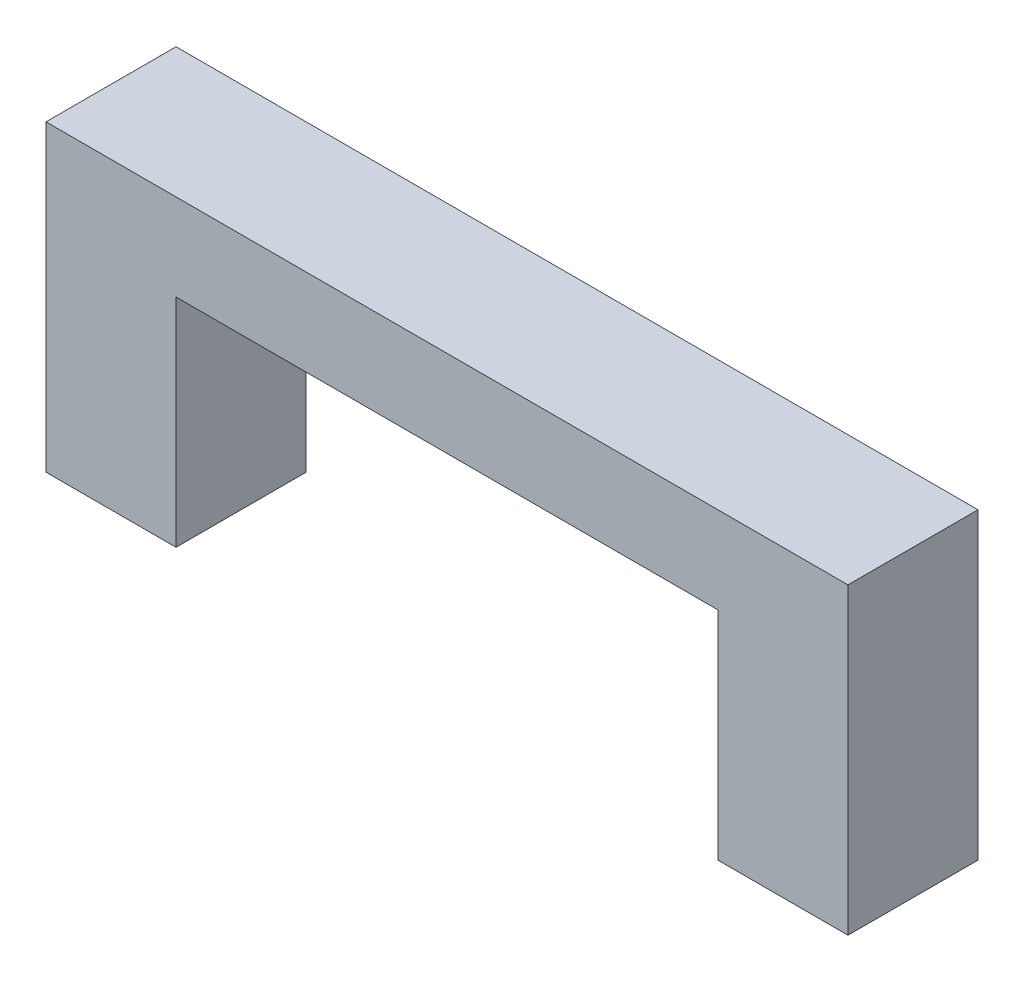
ISO-10303-21;
HEADER;
FILE_DESCRIPTION(('STEP AP214'),'2;1');
FILE_NAME('part.step','',(''),(''),'','','');
FILE_SCHEMA(('AUTOMOTIVE_DESIGN { 1 0 10303 214 1 1 1 1 }'));
ENDSEC;
DATA;
#1=APPLICATION_CONTEXT('core data for automotive mechanical design processes');
#2=APPLICATION_PROTOCOL_DEFINITION('international standard','automotive_design',2000,#1);
#3=PRODUCT_CONTEXT('',#1,'mechanical');
#4=PRODUCT('Part','Part','',(#3));
#5=PRODUCT_RELATED_PRODUCT_CATEGORY('part','',(#4));
#6=PRODUCT_DEFINITION_FORMATION('','',#4);
#7=PRODUCT_DEFINITION_CONTEXT('part definition',#1,'design');
#8=PRODUCT_DEFINITION('design','',#6,#7);
#9=PRODUCT_DEFINITION_SHAPE('','',#8);
#10=(LENGTH_UNIT() NAMED_UNIT(*) SI_UNIT(.MILLI.,.METRE.));
#11=(NAMED_UNIT(*) PLANE_ANGLE_UNIT() SI_UNIT($,.RADIAN.));
#12=(NAMED_UNIT(*) SI_UNIT($,.STERADIAN.) SOLID_ANGLE_UNIT());
#13=UNCERTAINTY_MEASURE_WITH_UNIT(LENGTH_MEASURE(1.E-05),#10,'distance_accuracy_value','');
#14=(GEOMETRIC_REPRESENTATION_CONTEXT(3) GLOBAL_UNCERTAINTY_ASSIGNED_CONTEXT((#13)) GLOBAL_UNIT_ASSIGNED_CONTEXT((#10,
#11,#12)) REPRESENTATION_CONTEXT('',''));
#15=CARTESIAN_POINT('',(0.,0.,0.));
#16=DIRECTION('',(0.,0.,1.));
#17=DIRECTION('',(1.,0.,0.));
#18=AXIS2_PLACEMENT_3D('',#15,#16,#17);
#19=CARTESIAN_POINT('',(18.5,0.,3.));
#20=DIRECTION('',(0.,1.,0.));
#21=DIRECTION('',(-1.,0.,0.));
#22=AXIS2_PLACEMENT_3D('',#19,#20,#21);
#23=PLANE('',#22);
#24=DIRECTION('',(1.,0.,0.));
#25=VECTOR('',#24,1.);
#26=CARTESIAN_POINT('',(18.5,0.,0.));
#27=LINE('',#26,#25);
#28=CARTESIAN_POINT('',(15.5,0.,0.));
#29=VERTEX_POINT('',#28);
#30=CARTESIAN_POINT('',(18.5,0.,0.));
#31=VERTEX_POINT('',#30);
#32=EDGE_CURVE('E236',#29,#31,#27,.T.);
#33=ORIENTED_EDGE('',*,*,#32,.T.);
#34=DIRECTION('',(0.,0.,-1.));
#35=VECTOR('',#34,1.);
#36=CARTESIAN_POINT('',(18.5,0.,3.));
#37=LINE('',#36,#35);
#38=CARTESIAN_POINT('',(18.5,0.,3.));
#39=VERTEX_POINT('',#38);
#40=EDGE_CURVE('E251',#39,#31,#37,.T.);
#41=ORIENTED_EDGE('',*,*,#40,.F.);
#42=DIRECTION('',(1.,0.,0.));
#43=VECTOR('',#42,1.);
#44=CARTESIAN_POINT('',(18.5,0.,3.));
#45=LINE('',#44,#43);
#46=CARTESIAN_POINT('',(15.5,0.,3.));
#47=VERTEX_POINT('',#46);
#48=EDGE_CURVE('E219',#47,#39,#45,.T.);
#49=ORIENTED_EDGE('',*,*,#48,.F.);
#50=DIRECTION('',(0.,0.,-1.));
#51=VECTOR('',#50,1.);
#52=CARTESIAN_POINT('',(15.5,0.,3.));
#53=LINE('',#52,#51);
#54=EDGE_CURVE('E254',#47,#29,#53,.T.);
#55=ORIENTED_EDGE('',*,*,#54,.T.);
#56=EDGE_LOOP('',(#33,#41,#49,#55));
#57=FACE_BOUND('',#56,.T.);
#58=DIRECTION('',(0.,0.,-1.));
#59=VECTOR('',#58,1.);
#60=CARTESIAN_POINT('',(17.75,0.,0.));
#61=LINE('',#60,#59);
#62=CARTESIAN_POINT('',(17.75,0.,2.25));
#63=VERTEX_POINT('',#62);
#64=CARTESIAN_POINT('',(17.75,0.,0.75));
#65=VERTEX_POINT('',#64);
#66=EDGE_CURVE('E56',#63,#65,#61,.T.);
#67=ORIENTED_EDGE('',*,*,#66,.T.);
#68=DIRECTION('',(1.,0.,0.));
#69=VECTOR('',#68,1.);
#70=CARTESIAN_POINT('',(0.,0.,0.75));
#71=LINE('',#70,#69);
#72=CARTESIAN_POINT('',(16.25,0.,0.75));
#73=VERTEX_POINT('',#72);
#74=EDGE_CURVE('E185',#73,#65,#71,.T.);
#75=ORIENTED_EDGE('',*,*,#74,.F.);
#76=DIRECTION('',(0.,0.,-1.));
#77=VECTOR('',#76,1.);
#78=CARTESIAN_POINT('',(16.25,0.,0.));
#79=LINE('',#78,#77);
#80=CARTESIAN_POINT('',(16.25,0.,2.25));
#81=VERTEX_POINT('',#80);
#82=EDGE_CURVE('E196',#81,#73,#79,.T.);
#83=ORIENTED_EDGE('',*,*,#82,.F.);
#84=DIRECTION('',(1.,0.,0.));
#85=VECTOR('',#84,1.);
#86=CARTESIAN_POINT('',(0.,0.,2.25));
#87=LINE('',#86,#85);
#88=EDGE_CURVE('E168',#81,#63,#87,.T.);
#89=ORIENTED_EDGE('',*,*,#88,.T.);
#90=EDGE_LOOP('',(#67,#75,#83,#89));
#91=FACE_BOUND('',#90,.T.);
#92=ADVANCED_FACE('F33',(#57,#91),#23,.F.);
#93=CARTESIAN_POINT('',(3.,0.,3.));
#94=DIRECTION('',(0.,1.,0.));
#95=DIRECTION('',(0.,0.,1.));
#96=AXIS2_PLACEMENT_3D('',#93,#94,#95);
#97=PLANE('',#96);
#98=DIRECTION('',(1.,0.,0.));
#99=VECTOR('',#98,1.);
#100=CARTESIAN_POINT('',(0.75,0.,0.75));
#101=LINE('',#100,#99);
#102=CARTESIAN_POINT('',(0.750000000000001,0.,0.75));
#103=VERTEX_POINT('',#102);
#104=CARTESIAN_POINT('',(2.25,0.,0.75));
#105=VERTEX_POINT('',#104);
#106=EDGE_CURVE('E166',#103,#105,#101,.T.);
#107=ORIENTED_EDGE('',*,*,#106,.F.);
#108=DIRECTION('',(0.,0.,-1.));
#109=VECTOR('',#108,1.);
#110=CARTESIAN_POINT('',(0.75,0.,2.25));
#111=LINE('',#110,#109);
#112=CARTESIAN_POINT('',(0.75,0.,2.25));
#113=VERTEX_POINT('',#112);
#114=EDGE_CURVE('E48',#113,#103,#111,.T.);
#115=ORIENTED_EDGE('',*,*,#114,.F.);
#116=DIRECTION('',(1.,0.,0.));
#117=VECTOR('',#116,1.);
#118=CARTESIAN_POINT('',(0.75,0.,2.25));
#119=LINE('',#118,#117);
#120=CARTESIAN_POINT('',(2.25,0.,2.25));
#121=VERTEX_POINT('',#120);
#122=EDGE_CURVE('E155',#113,#121,#119,.T.);
#123=ORIENTED_EDGE('',*,*,#122,.T.);
#124=DIRECTION('',(0.,0.,-1.));
#125=VECTOR('',#124,1.);
#126=CARTESIAN_POINT('',(2.25,0.,2.25));
#127=LINE('',#126,#125);
#128=EDGE_CURVE('E161',#121,#105,#127,.T.);
#129=ORIENTED_EDGE('',*,*,#128,.T.);
#130=EDGE_LOOP('',(#107,#115,#123,#129));
#131=FACE_BOUND('',#130,.T.);
#132=DIRECTION('',(1.,0.,0.));
#133=VECTOR('',#132,1.);
#134=CARTESIAN_POINT('',(3.,0.,0.));
#135=LINE('',#134,#133);
#136=CARTESIAN_POINT('',(0.,0.,0.));
#137=VERTEX_POINT('',#136);
#138=CARTESIAN_POINT('',(3.,0.,0.));
#139=VERTEX_POINT('',#138);
#140=EDGE_CURVE('E203',#137,#139,#135,.T.);
#141=ORIENTED_EDGE('',*,*,#140,.T.);
#142=DIRECTION('',(0.,0.,-1.));
#143=VECTOR('',#142,1.);
#144=CARTESIAN_POINT('',(3.,0.,3.));
#145=LINE('',#144,#143);
#146=CARTESIAN_POINT('',(3.,0.,3.));
#147=VERTEX_POINT('',#146);
#148=EDGE_CURVE('E11',#147,#139,#145,.T.);
#149=ORIENTED_EDGE('',*,*,#148,.F.);
#150=DIRECTION('',(1.,0.,0.));
#151=VECTOR('',#150,1.);
#152=CARTESIAN_POINT('',(3.,0.,3.));
#153=LINE('',#152,#151);
#154=CARTESIAN_POINT('',(0.,0.,3.));
#155=VERTEX_POINT('',#154);
#156=EDGE_CURVE('E209',#155,#147,#153,.T.);
#157=ORIENTED_EDGE('',*,*,#156,.F.);
#158=DIRECTION('',(0.,0.,-1.));
#159=VECTOR('',#158,1.);
#160=CARTESIAN_POINT('',(0.,0.,3.));
#161=LINE('',#160,#159);
#162=EDGE_CURVE('E227',#155,#137,#161,.T.);
#163=ORIENTED_EDGE('',*,*,#162,.T.);
#164=EDGE_LOOP('',(#141,#149,#157,#163));
#165=FACE_BOUND('',#164,.T.);
#166=ADVANCED_FACE('F35',(#131,#165),#97,.F.);
#167=CARTESIAN_POINT('',(3.,5.,3.));
#168=DIRECTION('',(-1.,0.,0.));
#169=DIRECTION('',(0.,0.,1.));
#170=AXIS2_PLACEMENT_3D('',#167,#168,#169);
#171=PLANE('',#170);
#172=DIRECTION('',(0.,1.,0.));
#173=VECTOR('',#172,1.);
#174=CARTESIAN_POINT('',(3.,5.,0.));
#175=LINE('',#174,#173);
#176=CARTESIAN_POINT('',(3.,5.,0.));
#177=VERTEX_POINT('',#176);
#178=EDGE_CURVE('E230',#139,#177,#175,.T.);
#179=ORIENTED_EDGE('',*,*,#178,.T.);
#180=DIRECTION('',(0.,0.,-1.));
#181=VECTOR('',#180,1.);
#182=CARTESIAN_POINT('',(3.,5.,3.));
#183=LINE('',#182,#181);
#184=CARTESIAN_POINT('',(3.,5.,3.));
#185=VERTEX_POINT('',#184);
#186=EDGE_CURVE('E41',#185,#177,#183,.T.);
#187=ORIENTED_EDGE('',*,*,#186,.F.);
#188=DIRECTION('',(0.,1.,0.));
#189=VECTOR('',#188,1.);
#190=CARTESIAN_POINT('',(3.,5.,3.));
#191=LINE('',#190,#189);
#192=EDGE_CURVE('E212',#147,#185,#191,.T.);
#193=ORIENTED_EDGE('',*,*,#192,.F.);
#194=ORIENTED_EDGE('',*,*,#148,.T.);
#195=EDGE_LOOP('',(#179,#187,#193,#194));
#196=FACE_BOUND('',#195,.T.);
#197=ADVANCED_FACE('F287',(#196),#171,.F.);
#198=CARTESIAN_POINT('',(15.5,5.,3.));
#199=DIRECTION('',(0.,1.,0.));
#200=DIRECTION('',(-1.,0.,0.));
#201=AXIS2_PLACEMENT_3D('',#198,#199,#200);
#202=PLANE('',#201);
#203=DIRECTION('',(1.,0.,0.));
#204=VECTOR('',#203,1.);
#205=CARTESIAN_POINT('',(15.5,5.,0.));
#206=LINE('',#205,#204);
#207=CARTESIAN_POINT('',(15.5,5.,0.));
#208=VERTEX_POINT('',#207);
#209=EDGE_CURVE('E232',#177,#208,#206,.T.);
#210=ORIENTED_EDGE('',*,*,#209,.T.);
#211=DIRECTION('',(0.,0.,-1.));
#212=VECTOR('',#211,1.);
#213=CARTESIAN_POINT('',(15.5,5.,3.));
#214=LINE('',#213,#212);
#215=CARTESIAN_POINT('',(15.5,5.,3.));
#216=VERTEX_POINT('',#215);
#217=EDGE_CURVE('E257',#216,#208,#214,.T.);
#218=ORIENTED_EDGE('',*,*,#217,.F.);
#219=DIRECTION('',(1.,0.,0.));
#220=VECTOR('',#219,1.);
#221=CARTESIAN_POINT('',(15.5,5.,3.));
#222=LINE('',#221,#220);
#223=EDGE_CURVE('E215',#185,#216,#222,.T.);
#224=ORIENTED_EDGE('',*,*,#223,.F.);
#225=ORIENTED_EDGE('',*,*,#186,.T.);
#226=EDGE_LOOP('',(#210,#218,#224,#225));
#227=FACE_BOUND('',#226,.T.);
#228=ADVANCED_FACE('F264',(#227),#202,.F.);
#229=CARTESIAN_POINT('',(15.5,0.,3.));
#230=DIRECTION('',(1.,0.,0.));
#231=DIRECTION('',(0.,0.,-1.));
#232=AXIS2_PLACEMENT_3D('',#229,#230,#231);
#233=PLANE('',#232);
#234=DIRECTION('',(0.,-1.,0.));
#235=VECTOR('',#234,1.);
#236=CARTESIAN_POINT('',(15.5,0.,0.));
#237=LINE('',#236,#235);
#238=EDGE_CURVE('E234',#208,#29,#237,.T.);
#239=ORIENTED_EDGE('',*,*,#238,.T.);
#240=ORIENTED_EDGE('',*,*,#54,.F.);
#241=DIRECTION('',(0.,-1.,0.));
#242=VECTOR('',#241,1.);
#243=CARTESIAN_POINT('',(15.5,0.,3.));
#244=LINE('',#243,#242);
#245=EDGE_CURVE('E217',#216,#47,#244,.T.);
#246=ORIENTED_EDGE('',*,*,#245,.F.);
#247=ORIENTED_EDGE('',*,*,#217,.T.);
#248=EDGE_LOOP('',(#239,#240,#246,#247));
#249=FACE_BOUND('',#248,.T.);
#250=ADVANCED_FACE('F275',(#249),#233,.F.);
#251=CARTESIAN_POINT('',(18.5,7.,3.));
#252=DIRECTION('',(-1.,0.,0.));
#253=DIRECTION('',(0.,0.,1.));
#254=AXIS2_PLACEMENT_3D('',#251,#252,#253);
#255=PLANE('',#254);
#256=DIRECTION('',(0.,1.,0.));
#257=VECTOR('',#256,1.);
#258=CARTESIAN_POINT('',(18.5,7.,0.));
#259=LINE('',#258,#257);
#260=CARTESIAN_POINT('',(18.5,7.,0.));
#261=VERTEX_POINT('',#260);
#262=EDGE_CURVE('E238',#31,#261,#259,.T.);
#263=ORIENTED_EDGE('',*,*,#262,.T.);
#264=DIRECTION('',(0.,0.,-1.));
#265=VECTOR('',#264,1.);
#266=CARTESIAN_POINT('',(18.5,7.,3.));
#267=LINE('',#266,#265);
#268=CARTESIAN_POINT('',(18.5,7.,3.));
#269=VERTEX_POINT('',#268);
#270=EDGE_CURVE('E248',#269,#261,#267,.T.);
#271=ORIENTED_EDGE('',*,*,#270,.F.);
#272=DIRECTION('',(0.,1.,0.));
#273=VECTOR('',#272,1.);
#274=CARTESIAN_POINT('',(18.5,7.,3.));
#275=LINE('',#274,#273);
#276=EDGE_CURVE('E221',#39,#269,#275,.T.);
#277=ORIENTED_EDGE('',*,*,#276,.F.);
#278=ORIENTED_EDGE('',*,*,#40,.T.);
#279=EDGE_LOOP('',(#263,#271,#277,#278));
#280=FACE_BOUND('',#279,.T.);
#281=ADVANCED_FACE('F299',(#280),#255,.F.);
#282=CARTESIAN_POINT('',(0.,7.,3.));
#283=DIRECTION('',(0.,-1.,0.));
#284=DIRECTION('',(0.,0.,-1.));
#285=AXIS2_PLACEMENT_3D('',#282,#283,#284);
#286=PLANE('',#285);
#287=DIRECTION('',(-1.,0.,0.));
#288=VECTOR('',#287,1.);
#289=CARTESIAN_POINT('',(0.,7.,0.));
#290=LINE('',#289,#288);
#291=CARTESIAN_POINT('',(0.,7.,0.));
#292=VERTEX_POINT('',#291);
#293=EDGE_CURVE('E240',#261,#292,#290,.T.);
#294=ORIENTED_EDGE('',*,*,#293,.T.);
#295=DIRECTION('',(0.,0.,-1.));
#296=VECTOR('',#295,1.);
#297=CARTESIAN_POINT('',(0.,7.,3.));
#298=LINE('',#297,#296);
#299=CARTESIAN_POINT('',(0.,7.,3.));
#300=VERTEX_POINT('',#299);
#301=EDGE_CURVE('E245',#300,#292,#298,.T.);
#302=ORIENTED_EDGE('',*,*,#301,.F.);
#303=DIRECTION('',(-1.,0.,0.));
#304=VECTOR('',#303,1.);
#305=CARTESIAN_POINT('',(0.,7.,3.));
#306=LINE('',#305,#304);
#307=EDGE_CURVE('E223',#269,#300,#306,.T.);
#308=ORIENTED_EDGE('',*,*,#307,.F.);
#309=ORIENTED_EDGE('',*,*,#270,.T.);
#310=EDGE_LOOP('',(#294,#302,#308,#309));
#311=FACE_BOUND('',#310,.T.);
#312=ADVANCED_FACE('F297',(#311),#286,.F.);
#313=CARTESIAN_POINT('',(0.,0.,3.));
#314=DIRECTION('',(1.,0.,0.));
#315=DIRECTION('',(0.,0.,-1.));
#316=AXIS2_PLACEMENT_3D('',#313,#314,#315);
#317=PLANE('',#316);
#318=DIRECTION('',(0.,-1.,0.));
#319=VECTOR('',#318,1.);
#320=CARTESIAN_POINT('',(0.,0.,0.));
#321=LINE('',#320,#319);
#322=EDGE_CURVE('E213',#292,#137,#321,.T.);
#323=ORIENTED_EDGE('',*,*,#322,.T.);
#324=ORIENTED_EDGE('',*,*,#162,.F.);
#325=DIRECTION('',(0.,-1.,0.));
#326=VECTOR('',#325,1.);
#327=CARTESIAN_POINT('',(0.,0.,3.));
#328=LINE('',#327,#326);
#329=EDGE_CURVE('E225',#300,#155,#328,.T.);
#330=ORIENTED_EDGE('',*,*,#329,.F.);
#331=ORIENTED_EDGE('',*,*,#301,.T.);
#332=EDGE_LOOP('',(#323,#324,#330,#331));
#333=FACE_BOUND('',#332,.T.);
#334=ADVANCED_FACE('F292',(#333),#317,.F.);
#335=CARTESIAN_POINT('',(0.,0.,3.));
#336=DIRECTION('',(0.,0.,-1.));
#337=DIRECTION('',(-1.,0.,0.));
#338=AXIS2_PLACEMENT_3D('',#335,#336,#337);
#339=PLANE('',#338);
#340=ORIENTED_EDGE('',*,*,#156,.T.);
#341=ORIENTED_EDGE('',*,*,#192,.T.);
#342=ORIENTED_EDGE('',*,*,#223,.T.);
#343=ORIENTED_EDGE('',*,*,#245,.T.);
#344=ORIENTED_EDGE('',*,*,#48,.T.);
#345=ORIENTED_EDGE('',*,*,#276,.T.);
#346=ORIENTED_EDGE('',*,*,#307,.T.);
#347=ORIENTED_EDGE('',*,*,#329,.T.);
#348=EDGE_LOOP('',(#340,#341,#342,#343,#344,#345,#346,#347));
#349=FACE_BOUND('',#348,.T.);
#350=ADVANCED_FACE('F283',(#349),#339,.F.);
#351=CARTESIAN_POINT('',(0.,0.,0.));
#352=DIRECTION('',(0.,0.,-1.));
#353=DIRECTION('',(-1.,0.,0.));
#354=AXIS2_PLACEMENT_3D('',#351,#352,#353);
#355=PLANE('',#354);
#356=ORIENTED_EDGE('',*,*,#140,.F.);
#357=ORIENTED_EDGE('',*,*,#322,.F.);
#358=ORIENTED_EDGE('',*,*,#293,.F.);
#359=ORIENTED_EDGE('',*,*,#262,.F.);
#360=ORIENTED_EDGE('',*,*,#32,.F.);
#361=ORIENTED_EDGE('',*,*,#238,.F.);
#362=ORIENTED_EDGE('',*,*,#209,.F.);
#363=ORIENTED_EDGE('',*,*,#178,.F.);
#364=EDGE_LOOP('',(#356,#357,#358,#359,#360,#361,#362,#363));
#365=FACE_BOUND('',#364,.T.);
#366=ADVANCED_FACE('F270',(#365),#355,.T.);
#367=CARTESIAN_POINT('',(17.75,2.,0.));
#368=DIRECTION('',(-1.,0.,0.));
#369=DIRECTION('',(0.,0.,1.));
#370=AXIS2_PLACEMENT_3D('',#367,#368,#369);
#371=PLANE('',#370);
#372=ORIENTED_EDGE('',*,*,#66,.F.);
#373=DIRECTION('',(0.,-1.,0.));
#374=VECTOR('',#373,1.);
#375=CARTESIAN_POINT('',(17.75,2.,2.25));
#376=LINE('',#375,#374);
#377=CARTESIAN_POINT('',(17.75,2.,2.25));
#378=VERTEX_POINT('',#377);
#379=EDGE_CURVE('E192',#378,#63,#376,.T.);
#380=ORIENTED_EDGE('',*,*,#379,.F.);
#381=DIRECTION('',(0.,0.,-1.));
#382=VECTOR('',#381,1.);
#383=CARTESIAN_POINT('',(17.75,2.,0.));
#384=LINE('',#383,#382);
#385=CARTESIAN_POINT('',(17.75,2.,0.75));
#386=VERTEX_POINT('',#385);
#387=EDGE_CURVE('E182',#378,#386,#384,.T.);
#388=ORIENTED_EDGE('',*,*,#387,.T.);
#389=DIRECTION('',(0.,-1.,0.));
#390=VECTOR('',#389,1.);
#391=CARTESIAN_POINT('',(17.75,2.,0.75));
#392=LINE('',#391,#390);
#393=EDGE_CURVE('E201',#386,#65,#392,.T.);
#394=ORIENTED_EDGE('',*,*,#393,.T.);
#395=EDGE_LOOP('',(#372,#380,#388,#394));
#396=FACE_BOUND('',#395,.T.);
#397=ADVANCED_FACE('F362',(#396),#371,.T.);
#398=CARTESIAN_POINT('',(0.,2.,0.75));
#399=DIRECTION('',(0.,0.,-1.));
#400=DIRECTION('',(-1.,0.,0.));
#401=AXIS2_PLACEMENT_3D('',#398,#399,#400);
#402=PLANE('',#401);
#403=ORIENTED_EDGE('',*,*,#74,.T.);
#404=ORIENTED_EDGE('',*,*,#393,.F.);
#405=DIRECTION('',(1.,0.,0.));
#406=VECTOR('',#405,1.);
#407=CARTESIAN_POINT('',(0.,2.,0.75));
#408=LINE('',#407,#406);
#409=CARTESIAN_POINT('',(16.25,2.,0.75));
#410=VERTEX_POINT('',#409);
#411=EDGE_CURVE('E190',#410,#386,#408,.T.);
#412=ORIENTED_EDGE('',*,*,#411,.F.);
#413=DIRECTION('',(0.,-1.,0.));
#414=VECTOR('',#413,1.);
#415=CARTESIAN_POINT('',(16.25,2.,0.75));
#416=LINE('',#415,#414);
#417=EDGE_CURVE('E204',#410,#73,#416,.T.);
#418=ORIENTED_EDGE('',*,*,#417,.T.);
#419=EDGE_LOOP('',(#403,#404,#412,#418));
#420=FACE_BOUND('',#419,.T.);
#421=ADVANCED_FACE('F380',(#420),#402,.F.);
#422=CARTESIAN_POINT('',(16.25,2.,0.));
#423=DIRECTION('',(-1.,0.,0.));
#424=DIRECTION('',(0.,0.,1.));
#425=AXIS2_PLACEMENT_3D('',#422,#423,#424);
#426=PLANE('',#425);
#427=ORIENTED_EDGE('',*,*,#82,.T.);
#428=ORIENTED_EDGE('',*,*,#417,.F.);
#429=DIRECTION('',(0.,0.,-1.));
#430=VECTOR('',#429,1.);
#431=CARTESIAN_POINT('',(16.25,2.,0.));
#432=LINE('',#431,#430);
#433=CARTESIAN_POINT('',(16.25,2.,2.25));
#434=VERTEX_POINT('',#433);
#435=EDGE_CURVE('E187',#434,#410,#432,.T.);
#436=ORIENTED_EDGE('',*,*,#435,.F.);
#437=DIRECTION('',(0.,-1.,0.));
#438=VECTOR('',#437,1.);
#439=CARTESIAN_POINT('',(16.25,2.,2.25));
#440=LINE('',#439,#438);
#441=EDGE_CURVE('E206',#434,#81,#440,.T.);
#442=ORIENTED_EDGE('',*,*,#441,.T.);
#443=EDGE_LOOP('',(#427,#428,#436,#442));
#444=FACE_BOUND('',#443,.T.);
#445=ADVANCED_FACE('F389',(#444),#426,.F.);
#446=CARTESIAN_POINT('',(0.,2.,2.25));
#447=DIRECTION('',(0.,0.,-1.));
#448=DIRECTION('',(-1.,0.,0.));
#449=AXIS2_PLACEMENT_3D('',#446,#447,#448);
#450=PLANE('',#449);
#451=ORIENTED_EDGE('',*,*,#88,.F.);
#452=ORIENTED_EDGE('',*,*,#441,.F.);
#453=DIRECTION('',(1.,0.,0.));
#454=VECTOR('',#453,1.);
#455=CARTESIAN_POINT('',(0.,2.,2.25));
#456=LINE('',#455,#454);
#457=EDGE_CURVE('E184',#434,#378,#456,.T.);
#458=ORIENTED_EDGE('',*,*,#457,.T.);
#459=ORIENTED_EDGE('',*,*,#379,.T.);
#460=EDGE_LOOP('',(#451,#452,#458,#459));
#461=FACE_BOUND('',#460,.T.);
#462=ADVANCED_FACE('F399',(#461),#450,.T.);
#463=CARTESIAN_POINT('',(0.,2.,0.));
#464=DIRECTION('',(0.,-1.,0.));
#465=DIRECTION('',(0.,0.,-1.));
#466=AXIS2_PLACEMENT_3D('',#463,#464,#465);
#467=PLANE('',#466);
#468=ORIENTED_EDGE('',*,*,#387,.F.);
#469=ORIENTED_EDGE('',*,*,#457,.F.);
#470=ORIENTED_EDGE('',*,*,#435,.T.);
#471=ORIENTED_EDGE('',*,*,#411,.T.);
#472=EDGE_LOOP('',(#468,#469,#470,#471));
#473=FACE_BOUND('',#472,.T.);
#474=ADVANCED_FACE('F409',(#473),#467,.T.);
#475=CARTESIAN_POINT('',(0.75,2.,2.25));
#476=DIRECTION('',(-1.,0.,0.));
#477=DIRECTION('',(0.,0.,1.));
#478=AXIS2_PLACEMENT_3D('',#475,#476,#477);
#479=PLANE('',#478);
#480=ORIENTED_EDGE('',*,*,#114,.T.);
#481=DIRECTION('',(0.,-1.,0.));
#482=VECTOR('',#481,1.);
#483=CARTESIAN_POINT('',(0.75,2.,0.75));
#484=LINE('',#483,#482);
#485=CARTESIAN_POINT('',(0.75,2.,0.75));
#486=VERTEX_POINT('',#485);
#487=EDGE_CURVE('E176',#486,#103,#484,.T.);
#488=ORIENTED_EDGE('',*,*,#487,.F.);
#489=DIRECTION('',(0.,0.,-1.));
#490=VECTOR('',#489,1.);
#491=CARTESIAN_POINT('',(0.75,2.,2.25));
#492=LINE('',#491,#490);
#493=CARTESIAN_POINT('',(0.75,2.,2.25));
#494=VERTEX_POINT('',#493);
#495=EDGE_CURVE('E149',#494,#486,#492,.T.);
#496=ORIENTED_EDGE('',*,*,#495,.F.);
#497=DIRECTION('',(0.,-1.,0.));
#498=VECTOR('',#497,1.);
#499=CARTESIAN_POINT('',(0.75,2.,2.25));
#500=LINE('',#499,#498);
#501=EDGE_CURVE('E145',#494,#113,#500,.T.);
#502=ORIENTED_EDGE('',*,*,#501,.T.);
#503=EDGE_LOOP('',(#480,#488,#496,#502));
#504=FACE_BOUND('',#503,.T.);
#505=ADVANCED_FACE('F147',(#504),#479,.F.);
#506=CARTESIAN_POINT('',(0.75,2.,2.25));
#507=DIRECTION('',(0.,0.,-1.));
#508=DIRECTION('',(-1.,0.,0.));
#509=AXIS2_PLACEMENT_3D('',#506,#507,#508);
#510=PLANE('',#509);
#511=ORIENTED_EDGE('',*,*,#122,.F.);
#512=ORIENTED_EDGE('',*,*,#501,.F.);
#513=DIRECTION('',(1.,0.,0.));
#514=VECTOR('',#513,1.);
#515=CARTESIAN_POINT('',(0.75,2.,2.25));
#516=LINE('',#515,#514);
#517=CARTESIAN_POINT('',(2.25,2.,2.25));
#518=VERTEX_POINT('',#517);
#519=EDGE_CURVE('E173',#494,#518,#516,.T.);
#520=ORIENTED_EDGE('',*,*,#519,.T.);
#521=DIRECTION('',(0.,-1.,0.));
#522=VECTOR('',#521,1.);
#523=CARTESIAN_POINT('',(2.25,2.,2.25));
#524=LINE('',#523,#522);
#525=EDGE_CURVE('E152',#518,#121,#524,.T.);
#526=ORIENTED_EDGE('',*,*,#525,.T.);
#527=EDGE_LOOP('',(#511,#512,#520,#526));
#528=FACE_BOUND('',#527,.T.);
#529=ADVANCED_FACE('F156',(#528),#510,.T.);
#530=CARTESIAN_POINT('',(2.25,2.,2.25));
#531=DIRECTION('',(-1.,0.,0.));
#532=DIRECTION('',(0.,0.,1.));
#533=AXIS2_PLACEMENT_3D('',#530,#531,#532);
#534=PLANE('',#533);
#535=ORIENTED_EDGE('',*,*,#128,.F.);
#536=ORIENTED_EDGE('',*,*,#525,.F.);
#537=DIRECTION('',(0.,0.,-1.));
#538=VECTOR('',#537,1.);
#539=CARTESIAN_POINT('',(2.25,2.,2.25));
#540=LINE('',#539,#538);
#541=CARTESIAN_POINT('',(2.25,2.,0.75));
#542=VERTEX_POINT('',#541);
#543=EDGE_CURVE('E175',#518,#542,#540,.T.);
#544=ORIENTED_EDGE('',*,*,#543,.T.);
#545=DIRECTION('',(0.,-1.,0.));
#546=VECTOR('',#545,1.);
#547=CARTESIAN_POINT('',(2.25,2.,0.75));
#548=LINE('',#547,#546);
#549=EDGE_CURVE('E472',#542,#105,#548,.T.);
#550=ORIENTED_EDGE('',*,*,#549,.T.);
#551=EDGE_LOOP('',(#535,#536,#544,#550));
#552=FACE_BOUND('',#551,.T.);
#553=ADVANCED_FACE('F436',(#552),#534,.T.);
#554=CARTESIAN_POINT('',(0.75,2.,0.75));
#555=DIRECTION('',(0.,0.,-1.));
#556=DIRECTION('',(-1.,0.,0.));
#557=AXIS2_PLACEMENT_3D('',#554,#555,#556);
#558=PLANE('',#557);
#559=ORIENTED_EDGE('',*,*,#106,.T.);
#560=ORIENTED_EDGE('',*,*,#549,.F.);
#561=DIRECTION('',(1.,0.,0.));
#562=VECTOR('',#561,1.);
#563=CARTESIAN_POINT('',(0.75,2.,0.75));
#564=LINE('',#563,#562);
#565=EDGE_CURVE('E178',#486,#542,#564,.T.);
#566=ORIENTED_EDGE('',*,*,#565,.F.);
#567=ORIENTED_EDGE('',*,*,#487,.T.);
#568=EDGE_LOOP('',(#559,#560,#566,#567));
#569=FACE_BOUND('',#568,.T.);
#570=ADVANCED_FACE('F445',(#569),#558,.F.);
#571=CARTESIAN_POINT('',(0.,2.,0.));
#572=DIRECTION('',(0.,-1.,0.));
#573=DIRECTION('',(0.,0.,-1.));
#574=AXIS2_PLACEMENT_3D('',#571,#572,#573);
#575=PLANE('',#574);
#576=ORIENTED_EDGE('',*,*,#495,.T.);
#577=ORIENTED_EDGE('',*,*,#565,.T.);
#578=ORIENTED_EDGE('',*,*,#543,.F.);
#579=ORIENTED_EDGE('',*,*,#519,.F.);
#580=EDGE_LOOP('',(#576,#577,#578,#579));
#581=FACE_BOUND('',#580,.T.);
#582=ADVANCED_FACE('F455',(#581),#575,.T.);
#583=CLOSED_SHELL('',(#92,#166,#197,#228,#250,#281,#312,#334,#350,#366,#397,#421,#445,#462,#474,
#505,#529,#553,#570,#582));
#584=MANIFOLD_SOLID_BREP('B2',#583);
#585=ADVANCED_BREP_SHAPE_REPRESENTATION('',(#18,#584),#14);
#586=SHAPE_DEFINITION_REPRESENTATION(#9,#585);
ENDSEC;
END-ISO-10303-21;
